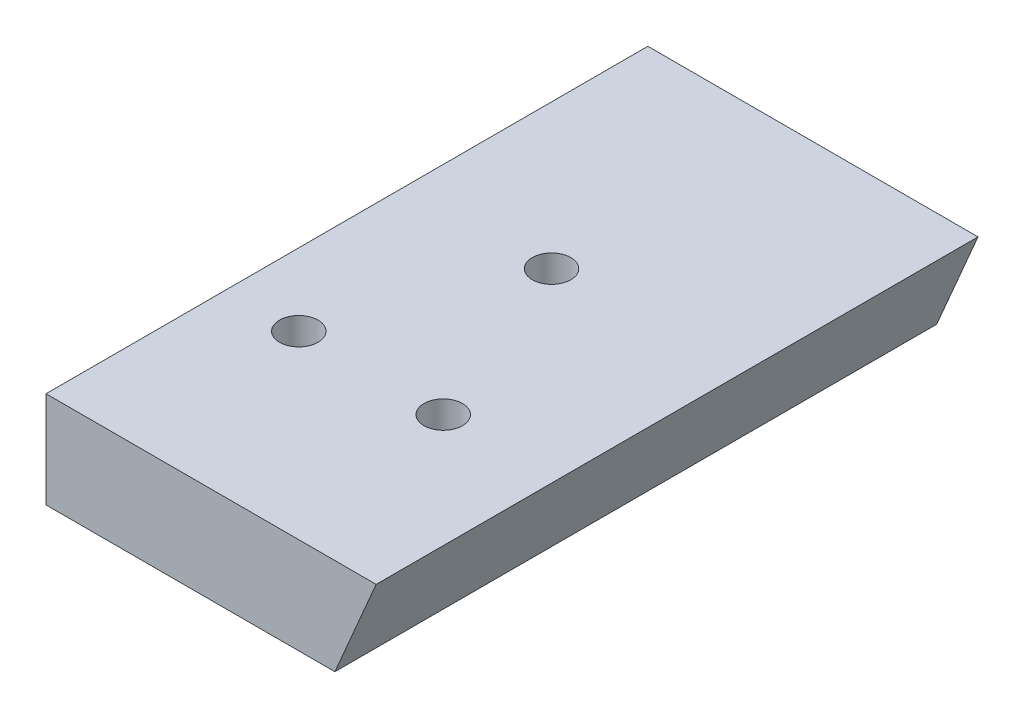
ISO-10303-21;
HEADER;
FILE_DESCRIPTION(('STEP AP214'),'2;1');
FILE_NAME('part.step','',(''),(''),'','','');
FILE_SCHEMA(('AUTOMOTIVE_DESIGN { 1 0 10303 214 1 1 1 1 }'));
ENDSEC;
DATA;
#1=APPLICATION_CONTEXT('core data for automotive mechanical design processes');
#2=APPLICATION_PROTOCOL_DEFINITION('international standard','automotive_design',2000,#1);
#3=PRODUCT_CONTEXT('',#1,'mechanical');
#4=PRODUCT('Part','Part','',(#3));
#5=PRODUCT_RELATED_PRODUCT_CATEGORY('part','',(#4));
#6=PRODUCT_DEFINITION_FORMATION('','',#4);
#7=PRODUCT_DEFINITION_CONTEXT('part definition',#1,'design');
#8=PRODUCT_DEFINITION('design','',#6,#7);
#9=PRODUCT_DEFINITION_SHAPE('','',#8);
#10=(LENGTH_UNIT() NAMED_UNIT(*) SI_UNIT(.MILLI.,.METRE.));
#11=(NAMED_UNIT(*) PLANE_ANGLE_UNIT() SI_UNIT($,.RADIAN.));
#12=(NAMED_UNIT(*) SI_UNIT($,.STERADIAN.) SOLID_ANGLE_UNIT());
#13=UNCERTAINTY_MEASURE_WITH_UNIT(LENGTH_MEASURE(1.E-05),#10,'distance_accuracy_value','');
#14=(GEOMETRIC_REPRESENTATION_CONTEXT(3) GLOBAL_UNCERTAINTY_ASSIGNED_CONTEXT((#13)) GLOBAL_UNIT_ASSIGNED_CONTEXT((#10,
#11,#12)) REPRESENTATION_CONTEXT('',''));
#15=CARTESIAN_POINT('',(0.,0.,0.));
#16=DIRECTION('',(0.,0.,1.));
#17=DIRECTION('',(1.,0.,0.));
#18=AXIS2_PLACEMENT_3D('',#15,#16,#17);
#19=CARTESIAN_POINT('',(0.,0.,0.));
#20=DIRECTION('',(0.,0.,1.));
#21=DIRECTION('',(1.,0.,0.));
#22=AXIS2_PLACEMENT_3D('',#19,#20,#21);
#23=PLANE('',#22);
#24=DIRECTION('',(0.,-1.,0.));
#25=VECTOR('',#24,1.);
#26=CARTESIAN_POINT('',(45.7615337539128,80.3248750291424,0.));
#27=LINE('',#26,#25);
#28=CARTESIAN_POINT('',(45.7615337539128,80.3248750291424,0.));
#29=VERTEX_POINT('',#28);
#30=CARTESIAN_POINT('',(45.7615337539128,72.3248750291424,0.));
#31=VERTEX_POINT('',#30);
#32=EDGE_CURVE('E96',#29,#31,#27,.T.);
#33=ORIENTED_EDGE('',*,*,#32,.F.);
#34=DIRECTION('',(-1.,0.,0.));
#35=VECTOR('',#34,1.);
#36=CARTESIAN_POINT('',(45.7615337539128,80.3248750291424,0.));
#37=LINE('',#36,#35);
#38=CARTESIAN_POINT('',(73.1901051824842,80.3248750291424,0.));
#39=VERTEX_POINT('',#38);
#40=EDGE_CURVE('E102',#39,#29,#37,.T.);
#41=ORIENTED_EDGE('',*,*,#40,.F.);
#42=DIRECTION('',(0.393919298579168,0.919145030018058,0.));
#43=VECTOR('',#42,1.);
#44=CARTESIAN_POINT('',(73.1901051824842,80.3248750291424,0.));
#45=LINE('',#44,#43);
#46=CARTESIAN_POINT('',(69.7615337539128,72.3248750291424,0.));
#47=VERTEX_POINT('',#46);
#48=EDGE_CURVE('E120',#47,#39,#45,.T.);
#49=ORIENTED_EDGE('',*,*,#48,.F.);
#50=DIRECTION('',(1.,0.,0.));
#51=VECTOR('',#50,1.);
#52=CARTESIAN_POINT('',(45.7615337539128,72.3248750291424,0.));
#53=LINE('',#52,#51);
#54=EDGE_CURVE('E110',#31,#47,#53,.T.);
#55=ORIENTED_EDGE('',*,*,#54,.F.);
#56=EDGE_LOOP('',(#33,#41,#49,#55));
#57=FACE_BOUND('',#56,.T.);
#58=CARTESIAN_POINT('',(52.6186766110557,76.3248750291424,0.));
#59=DIRECTION('',(0.,0.,1.));
#60=DIRECTION('',(1.,0.,0.));
#61=AXIS2_PLACEMENT_3D('',#58,#59,#60);
#62=CIRCLE('',#61,1.9);
#63=CARTESIAN_POINT('',(54.5186766110557,76.3248750291424,0.));
#64=VERTEX_POINT('',#63);
#65=EDGE_CURVE('E144',#64,#64,#62,.T.);
#66=ORIENTED_EDGE('',*,*,#65,.T.);
#67=EDGE_LOOP('',(#66));
#68=FACE_BOUND('',#67,.T.);
#69=CARTESIAN_POINT('',(66.3329623253414,76.3248750291424,0.));
#70=DIRECTION('',(0.,0.,-1.));
#71=DIRECTION('',(-1.,0.,0.));
#72=AXIS2_PLACEMENT_3D('',#69,#70,#71);
#73=CIRCLE('',#72,1.9);
#74=CARTESIAN_POINT('',(64.4329623253414,76.3248750291424,0.));
#75=VERTEX_POINT('',#74);
#76=EDGE_CURVE('E147',#75,#75,#73,.T.);
#77=ORIENTED_EDGE('',*,*,#76,.F.);
#78=EDGE_LOOP('',(#77));
#79=FACE_BOUND('',#78,.T.);
#80=ADVANCED_FACE('F47',(#57,#68,#79),#23,.F.);
#81=CARTESIAN_POINT('',(45.7615337539128,72.3248750291424,78.5714285714286));
#82=DIRECTION('',(0.,1.,0.));
#83=DIRECTION('',(0.,0.,1.));
#84=AXIS2_PLACEMENT_3D('',#81,#82,#83);
#85=PLANE('',#84);
#86=CARTESIAN_POINT('',(63.7615337539128,72.3248750291424,35.));
#87=DIRECTION('',(0.,-1.,0.));
#88=DIRECTION('',(0.,0.,-1.));
#89=AXIS2_PLACEMENT_3D('',#86,#87,#88);
#90=CIRCLE('',#89,1.60000000000001);
#91=CARTESIAN_POINT('',(63.7615337539128,72.3248750291424,33.4));
#92=VERTEX_POINT('',#91);
#93=EDGE_CURVE('E126',#92,#92,#90,.T.);
#94=ORIENTED_EDGE('',*,*,#93,.F.);
#95=EDGE_LOOP('',(#94));
#96=FACE_BOUND('',#95,.T.);
#97=CARTESIAN_POINT('',(57.7615337539128,72.3248750291424,20.));
#98=DIRECTION('',(0.,-1.,0.));
#99=DIRECTION('',(0.,0.,-1.));
#100=AXIS2_PLACEMENT_3D('',#97,#98,#99);
#101=CIRCLE('',#100,1.6);
#102=CARTESIAN_POINT('',(57.7615337539128,72.3248750291424,18.4));
#103=VERTEX_POINT('',#102);
#104=EDGE_CURVE('E127',#103,#103,#101,.T.);
#105=ORIENTED_EDGE('',*,*,#104,.F.);
#106=EDGE_LOOP('',(#105));
#107=FACE_BOUND('',#106,.T.);
#108=DIRECTION('',(1.,0.,0.));
#109=VECTOR('',#108,1.);
#110=CARTESIAN_POINT('',(45.7615337539128,72.3248750291424,50.));
#111=LINE('',#110,#109);
#112=CARTESIAN_POINT('',(45.7615337539128,72.3248750291424,50.));
#113=VERTEX_POINT('',#112);
#114=CARTESIAN_POINT('',(69.7615337539128,72.3248750291424,50.));
#115=VERTEX_POINT('',#114);
#116=EDGE_CURVE('E56',#113,#115,#111,.T.);
#117=ORIENTED_EDGE('',*,*,#116,.F.);
#118=DIRECTION('',(0.,0.,-1.));
#119=VECTOR('',#118,1.);
#120=CARTESIAN_POINT('',(45.7615337539128,72.3248750291424,78.5714285714286));
#121=LINE('',#120,#119);
#122=EDGE_CURVE('E86',#113,#31,#121,.T.);
#123=ORIENTED_EDGE('',*,*,#122,.T.);
#124=ORIENTED_EDGE('',*,*,#54,.T.);
#125=DIRECTION('',(0.,0.,-1.));
#126=VECTOR('',#125,1.);
#127=CARTESIAN_POINT('',(69.7615337539128,72.3248750291424,78.5714285714286));
#128=LINE('',#127,#126);
#129=EDGE_CURVE('E119',#115,#47,#128,.T.);
#130=ORIENTED_EDGE('',*,*,#129,.F.);
#131=EDGE_LOOP('',(#117,#123,#124,#130));
#132=FACE_BOUND('',#131,.T.);
#133=CARTESIAN_POINT('',(51.7615337539128,72.3248750291424,35.));
#134=DIRECTION('',(0.,-1.,0.));
#135=DIRECTION('',(0.,0.,-1.));
#136=AXIS2_PLACEMENT_3D('',#133,#134,#135);
#137=CIRCLE('',#136,1.60000000000001);
#138=CARTESIAN_POINT('',(51.7615337539128,72.3248750291424,33.4));
#139=VERTEX_POINT('',#138);
#140=EDGE_CURVE('E100',#139,#139,#137,.F.);
#141=ORIENTED_EDGE('',*,*,#140,.T.);
#142=EDGE_LOOP('',(#141));
#143=FACE_BOUND('',#142,.T.);
#144=ADVANCED_FACE('F163',(#96,#107,#132,#143),#85,.F.);
#145=CARTESIAN_POINT('',(45.7615337539128,80.3248750291424,78.5714285714286));
#146=DIRECTION('',(0.,-1.,0.));
#147=DIRECTION('',(0.,0.,-1.));
#148=AXIS2_PLACEMENT_3D('',#145,#146,#147);
#149=PLANE('',#148);
#150=CARTESIAN_POINT('',(63.7615337539128,80.3248750291424,35.));
#151=DIRECTION('',(0.,-1.,0.));
#152=DIRECTION('',(0.,0.,-1.));
#153=AXIS2_PLACEMENT_3D('',#150,#151,#152);
#154=CIRCLE('',#153,1.60000000000001);
#155=CARTESIAN_POINT('',(63.7615337539128,80.3248750291424,33.4));
#156=VERTEX_POINT('',#155);
#157=EDGE_CURVE('E131',#156,#156,#154,.F.);
#158=ORIENTED_EDGE('',*,*,#157,.F.);
#159=EDGE_LOOP('',(#158));
#160=FACE_BOUND('',#159,.T.);
#161=CARTESIAN_POINT('',(57.7615337539128,80.3248750291424,20.));
#162=DIRECTION('',(0.,-1.,0.));
#163=DIRECTION('',(0.,0.,-1.));
#164=AXIS2_PLACEMENT_3D('',#161,#162,#163);
#165=CIRCLE('',#164,1.6);
#166=CARTESIAN_POINT('',(57.7615337539128,80.3248750291424,18.4));
#167=VERTEX_POINT('',#166);
#168=EDGE_CURVE('E123',#167,#167,#165,.F.);
#169=ORIENTED_EDGE('',*,*,#168,.F.);
#170=EDGE_LOOP('',(#169));
#171=FACE_BOUND('',#170,.T.);
#172=DIRECTION('',(-1.,0.,0.));
#173=VECTOR('',#172,1.);
#174=CARTESIAN_POINT('',(45.7615337539128,80.3248750291424,50.));
#175=LINE('',#174,#173);
#176=CARTESIAN_POINT('',(73.1901051824842,80.3248750291424,50.));
#177=VERTEX_POINT('',#176);
#178=CARTESIAN_POINT('',(45.7615337539128,80.3248750291424,50.));
#179=VERTEX_POINT('',#178);
#180=EDGE_CURVE('E107',#177,#179,#175,.T.);
#181=ORIENTED_EDGE('',*,*,#180,.F.);
#182=DIRECTION('',(0.,0.,-1.));
#183=VECTOR('',#182,1.);
#184=CARTESIAN_POINT('',(73.1901051824842,80.3248750291424,78.5714285714286));
#185=LINE('',#184,#183);
#186=EDGE_CURVE('E69',#177,#39,#185,.T.);
#187=ORIENTED_EDGE('',*,*,#186,.T.);
#188=ORIENTED_EDGE('',*,*,#40,.T.);
#189=DIRECTION('',(0.,0.,-1.));
#190=VECTOR('',#189,1.);
#191=CARTESIAN_POINT('',(45.7615337539128,80.3248750291424,78.5714285714286));
#192=LINE('',#191,#190);
#193=EDGE_CURVE('E51',#179,#29,#192,.T.);
#194=ORIENTED_EDGE('',*,*,#193,.F.);
#195=EDGE_LOOP('',(#181,#187,#188,#194));
#196=FACE_BOUND('',#195,.T.);
#197=CARTESIAN_POINT('',(51.7615337539128,80.3248750291424,35.));
#198=DIRECTION('',(0.,-1.,0.));
#199=DIRECTION('',(0.,0.,-1.));
#200=AXIS2_PLACEMENT_3D('',#197,#198,#199);
#201=CIRCLE('',#200,1.60000000000001);
#202=CARTESIAN_POINT('',(51.7615337539128,80.3248750291424,33.4));
#203=VERTEX_POINT('',#202);
#204=EDGE_CURVE('E134',#203,#203,#201,.T.);
#205=ORIENTED_EDGE('',*,*,#204,.T.);
#206=EDGE_LOOP('',(#205));
#207=FACE_BOUND('',#206,.T.);
#208=ADVANCED_FACE('F103',(#160,#171,#196,#207),#149,.F.);
#209=CARTESIAN_POINT('',(45.7615337539128,80.3248750291424,78.5714285714286));
#210=DIRECTION('',(1.,0.,0.));
#211=DIRECTION('',(0.,0.,-1.));
#212=AXIS2_PLACEMENT_3D('',#209,#210,#211);
#213=PLANE('',#212);
#214=DIRECTION('',(0.,-1.,0.));
#215=VECTOR('',#214,1.);
#216=CARTESIAN_POINT('',(45.7615337539128,80.3248750291424,50.));
#217=LINE('',#216,#215);
#218=EDGE_CURVE('E98',#179,#113,#217,.T.);
#219=ORIENTED_EDGE('',*,*,#218,.F.);
#220=ORIENTED_EDGE('',*,*,#193,.T.);
#221=ORIENTED_EDGE('',*,*,#32,.T.);
#222=ORIENTED_EDGE('',*,*,#122,.F.);
#223=EDGE_LOOP('',(#219,#220,#221,#222));
#224=FACE_BOUND('',#223,.T.);
#225=ADVANCED_FACE('F94',(#224),#213,.F.);
#226=CARTESIAN_POINT('',(73.1901051824842,80.3248750291424,78.5714285714286));
#227=DIRECTION('',(-0.919145030018058,0.393919298579168,0.));
#228=DIRECTION('',(-0.393919298579168,-0.919145030018058,0.));
#229=AXIS2_PLACEMENT_3D('',#226,#227,#228);
#230=PLANE('',#229);
#231=DIRECTION('',(0.393919298579168,0.919145030018058,0.));
#232=VECTOR('',#231,1.);
#233=CARTESIAN_POINT('',(73.1901051824842,80.3248750291424,50.));
#234=LINE('',#233,#232);
#235=EDGE_CURVE('E13',#115,#177,#234,.T.);
#236=ORIENTED_EDGE('',*,*,#235,.F.);
#237=ORIENTED_EDGE('',*,*,#129,.T.);
#238=ORIENTED_EDGE('',*,*,#48,.T.);
#239=ORIENTED_EDGE('',*,*,#186,.F.);
#240=EDGE_LOOP('',(#236,#237,#238,#239));
#241=FACE_BOUND('',#240,.T.);
#242=ADVANCED_FACE('F177',(#241),#230,.F.);
#243=CARTESIAN_POINT('',(0.,0.,50.));
#244=DIRECTION('',(0.,0.,1.));
#245=DIRECTION('',(1.,0.,0.));
#246=AXIS2_PLACEMENT_3D('',#243,#244,#245);
#247=PLANE('',#246);
#248=ORIENTED_EDGE('',*,*,#180,.T.);
#249=ORIENTED_EDGE('',*,*,#218,.T.);
#250=ORIENTED_EDGE('',*,*,#116,.T.);
#251=ORIENTED_EDGE('',*,*,#235,.T.);
#252=EDGE_LOOP('',(#248,#249,#250,#251));
#253=FACE_BOUND('',#252,.T.);
#254=ADVANCED_FACE('F49',(#253),#247,.T.);
#255=CARTESIAN_POINT('',(57.7615337539128,80.3258750291424,20.));
#256=DIRECTION('',(0.,-1.,0.));
#257=DIRECTION('',(0.,0.,-1.));
#258=AXIS2_PLACEMENT_3D('',#255,#256,#257);
#259=CYLINDRICAL_SURFACE('',#258,1.6);
#260=ORIENTED_EDGE('',*,*,#104,.T.);
#261=EDGE_LOOP('',(#260));
#262=FACE_BOUND('',#261,.T.);
#263=ORIENTED_EDGE('',*,*,#168,.T.);
#264=EDGE_LOOP('',(#263));
#265=FACE_BOUND('',#264,.T.);
#266=ADVANCED_FACE('F172',(#262,#265),#259,.F.);
#267=CARTESIAN_POINT('',(63.7615337539128,80.3258750291424,35.));
#268=DIRECTION('',(0.,-1.,0.));
#269=DIRECTION('',(0.,0.,-1.));
#270=AXIS2_PLACEMENT_3D('',#267,#268,#269);
#271=CYLINDRICAL_SURFACE('',#270,1.60000000000001);
#272=ORIENTED_EDGE('',*,*,#93,.T.);
#273=EDGE_LOOP('',(#272));
#274=FACE_BOUND('',#273,.T.);
#275=ORIENTED_EDGE('',*,*,#157,.T.);
#276=EDGE_LOOP('',(#275));
#277=FACE_BOUND('',#276,.T.);
#278=ADVANCED_FACE('F201',(#274,#277),#271,.F.);
#279=CARTESIAN_POINT('',(51.7615337539128,80.3258750291424,35.));
#280=DIRECTION('',(0.,-1.,0.));
#281=DIRECTION('',(0.,0.,-1.));
#282=AXIS2_PLACEMENT_3D('',#279,#280,#281);
#283=CYLINDRICAL_SURFACE('',#282,1.60000000000001);
#284=ORIENTED_EDGE('',*,*,#140,.F.);
#285=EDGE_LOOP('',(#284));
#286=FACE_BOUND('',#285,.T.);
#287=ORIENTED_EDGE('',*,*,#204,.F.);
#288=EDGE_LOOP('',(#287));
#289=FACE_BOUND('',#288,.T.);
#290=ADVANCED_FACE('F208',(#286,#289),#283,.F.);
#291=CARTESIAN_POINT('',(52.6186766110557,76.3248750291424,10.));
#292=DIRECTION('',(0.,0.,-1.));
#293=DIRECTION('',(-1.,0.,0.));
#294=AXIS2_PLACEMENT_3D('',#291,#292,#293);
#295=CYLINDRICAL_SURFACE('',#294,1.9);
#296=CARTESIAN_POINT('',(52.6186766110557,76.3248750291424,10.));
#297=DIRECTION('',(0.,0.,1.));
#298=DIRECTION('',(1.,0.,0.));
#299=AXIS2_PLACEMENT_3D('',#296,#297,#298);
#300=CIRCLE('',#299,1.9);
#301=CARTESIAN_POINT('',(54.5186766110557,76.3248750291424,10.));
#302=VERTEX_POINT('',#301);
#303=EDGE_CURVE('E141',#302,#302,#300,.T.);
#304=ORIENTED_EDGE('',*,*,#303,.T.);
#305=EDGE_LOOP('',(#304));
#306=FACE_BOUND('',#305,.T.);
#307=ORIENTED_EDGE('',*,*,#65,.F.);
#308=EDGE_LOOP('',(#307));
#309=FACE_BOUND('',#308,.T.);
#310=ADVANCED_FACE('F215',(#306,#309),#295,.F.);
#311=CARTESIAN_POINT('',(52.6186766110557,76.3248750291424,10.));
#312=DIRECTION('',(0.,0.,1.));
#313=DIRECTION('',(1.,0.,0.));
#314=AXIS2_PLACEMENT_3D('',#311,#312,#313);
#315=PLANE('',#314);
#316=ORIENTED_EDGE('',*,*,#303,.F.);
#317=EDGE_LOOP('',(#316));
#318=FACE_BOUND('',#317,.T.);
#319=ADVANCED_FACE('F158',(#318),#315,.F.);
#320=CARTESIAN_POINT('',(66.3329623253414,76.3248750291424,10.));
#321=DIRECTION('',(0.,0.,-1.));
#322=DIRECTION('',(-1.,0.,0.));
#323=AXIS2_PLACEMENT_3D('',#320,#321,#322);
#324=CYLINDRICAL_SURFACE('',#323,1.9);
#325=CARTESIAN_POINT('',(66.3329623253414,76.3248750291424,10.));
#326=DIRECTION('',(0.,0.,-1.));
#327=DIRECTION('',(-1.,0.,0.));
#328=AXIS2_PLACEMENT_3D('',#325,#326,#327);
#329=CIRCLE('',#328,1.9);
#330=CARTESIAN_POINT('',(64.4329623253414,76.3248750291424,10.));
#331=VERTEX_POINT('',#330);
#332=EDGE_CURVE('E130',#331,#331,#329,.T.);
#333=ORIENTED_EDGE('',*,*,#332,.F.);
#334=EDGE_LOOP('',(#333));
#335=FACE_BOUND('',#334,.T.);
#336=ORIENTED_EDGE('',*,*,#76,.T.);
#337=EDGE_LOOP('',(#336));
#338=FACE_BOUND('',#337,.T.);
#339=ADVANCED_FACE('F155',(#335,#338),#324,.F.);
#340=CARTESIAN_POINT('',(66.3329623253414,76.3248750291424,10.));
#341=DIRECTION('',(0.,0.,-1.));
#342=DIRECTION('',(-1.,0.,0.));
#343=AXIS2_PLACEMENT_3D('',#340,#341,#342);
#344=PLANE('',#343);
#345=ORIENTED_EDGE('',*,*,#332,.T.);
#346=EDGE_LOOP('',(#345));
#347=FACE_BOUND('',#346,.T.);
#348=ADVANCED_FACE('F153',(#347),#344,.T.);
#349=CLOSED_SHELL('',(#80,#144,#208,#225,#242,#254,#266,#278,#290,#310,#319,#339,#348));
#350=MANIFOLD_SOLID_BREP('B2',#349);
#351=ADVANCED_BREP_SHAPE_REPRESENTATION('',(#18,#350),#14);
#352=SHAPE_DEFINITION_REPRESENTATION(#9,#351);
ENDSEC;
END-ISO-10303-21;
